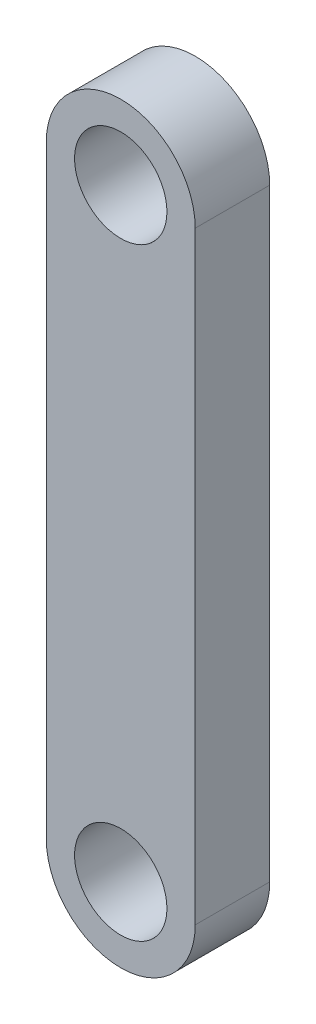
ISO-10303-21;
HEADER;
FILE_DESCRIPTION(('STEP AP214'),'2;1');
FILE_NAME('part.step','',(''),(''),'','','');
FILE_SCHEMA(('AUTOMOTIVE_DESIGN { 1 0 10303 214 1 1 1 1 }'));
ENDSEC;
DATA;
#1=APPLICATION_CONTEXT('core data for automotive mechanical design processes');
#2=APPLICATION_PROTOCOL_DEFINITION('international standard','automotive_design',2000,#1);
#3=PRODUCT_CONTEXT('',#1,'mechanical');
#4=PRODUCT('Part','Part','',(#3));
#5=PRODUCT_RELATED_PRODUCT_CATEGORY('part','',(#4));
#6=PRODUCT_DEFINITION_FORMATION('','',#4);
#7=PRODUCT_DEFINITION_CONTEXT('part definition',#1,'design');
#8=PRODUCT_DEFINITION('design','',#6,#7);
#9=PRODUCT_DEFINITION_SHAPE('','',#8);
#10=(LENGTH_UNIT() NAMED_UNIT(*) SI_UNIT(.MILLI.,.METRE.));
#11=(NAMED_UNIT(*) PLANE_ANGLE_UNIT() SI_UNIT($,.RADIAN.));
#12=(NAMED_UNIT(*) SI_UNIT($,.STERADIAN.) SOLID_ANGLE_UNIT());
#13=UNCERTAINTY_MEASURE_WITH_UNIT(LENGTH_MEASURE(1.E-05),#10,'distance_accuracy_value','');
#14=(GEOMETRIC_REPRESENTATION_CONTEXT(3) GLOBAL_UNCERTAINTY_ASSIGNED_CONTEXT((#13)) GLOBAL_UNIT_ASSIGNED_CONTEXT((#10,
#11,#12)) REPRESENTATION_CONTEXT('',''));
#15=CARTESIAN_POINT('',(0.,0.,0.));
#16=DIRECTION('',(0.,0.,1.));
#17=DIRECTION('',(1.,0.,0.));
#18=AXIS2_PLACEMENT_3D('',#15,#16,#17);
#19=CARTESIAN_POINT('',(0.,38.0750020317063,6.35));
#20=DIRECTION('',(0.,0.,1.));
#21=DIRECTION('',(1.,0.,0.));
#22=AXIS2_PLACEMENT_3D('',#19,#20,#21);
#23=PLANE('',#22);
#24=CARTESIAN_POINT('',(0.,38.0750020317063,6.35));
#25=DIRECTION('',(0.,0.,1.));
#26=DIRECTION('',(1.,0.,0.));
#27=AXIS2_PLACEMENT_3D('',#24,#25,#26);
#28=CIRCLE('',#27,3.937);
#29=CARTESIAN_POINT('',(3.937,38.0750020317063,6.35));
#30=VERTEX_POINT('',#29);
#31=EDGE_CURVE('E99',#30,#30,#28,.T.);
#32=ORIENTED_EDGE('',*,*,#31,.F.);
#33=EDGE_LOOP('',(#32));
#34=FACE_BOUND('',#33,.T.);
#35=CARTESIAN_POINT('',(0.,38.0750020317063,6.35));
#36=DIRECTION('',(0.,0.,1.));
#37=DIRECTION('',(1.,0.,0.));
#38=AXIS2_PLACEMENT_3D('',#35,#36,#37);
#39=CIRCLE('',#38,6.35);
#40=CARTESIAN_POINT('',(6.35,38.0750020317063,6.35));
#41=VERTEX_POINT('',#40);
#42=CARTESIAN_POINT('',(-6.35,38.0750020317063,6.35));
#43=VERTEX_POINT('',#42);
#44=EDGE_CURVE('E84',#41,#43,#39,.T.);
#45=ORIENTED_EDGE('',*,*,#44,.T.);
#46=DIRECTION('',(0.,-1.,0.));
#47=VECTOR('',#46,1.);
#48=CARTESIAN_POINT('',(-6.35,38.0750020317063,6.35));
#49=LINE('',#48,#47);
#50=CARTESIAN_POINT('',(-6.35,-13.3599979682937,6.35));
#51=VERTEX_POINT('',#50);
#52=EDGE_CURVE('E79',#43,#51,#49,.T.);
#53=ORIENTED_EDGE('',*,*,#52,.T.);
#54=CARTESIAN_POINT('',(0.,-13.3599979682937,6.35));
#55=DIRECTION('',(0.,0.,1.));
#56=DIRECTION('',(1.,0.,0.));
#57=AXIS2_PLACEMENT_3D('',#54,#55,#56);
#58=CIRCLE('',#57,6.35);
#59=CARTESIAN_POINT('',(6.35000000000001,-13.3599979682937,6.35));
#60=VERTEX_POINT('',#59);
#61=EDGE_CURVE('E82',#51,#60,#58,.T.);
#62=ORIENTED_EDGE('',*,*,#61,.T.);
#63=DIRECTION('',(0.,1.,0.));
#64=VECTOR('',#63,1.);
#65=CARTESIAN_POINT('',(6.35,38.0750020317063,6.35));
#66=LINE('',#65,#64);
#67=EDGE_CURVE('E49',#60,#41,#66,.T.);
#68=ORIENTED_EDGE('',*,*,#67,.T.);
#69=EDGE_LOOP('',(#45,#53,#62,#68));
#70=FACE_BOUND('',#69,.T.);
#71=CARTESIAN_POINT('',(0.,-13.3599979682937,6.35));
#72=DIRECTION('',(0.,0.,1.));
#73=DIRECTION('',(1.,0.,0.));
#74=AXIS2_PLACEMENT_3D('',#71,#72,#73);
#75=CIRCLE('',#74,3.937);
#76=CARTESIAN_POINT('',(3.937,-13.3599979682937,6.35));
#77=VERTEX_POINT('',#76);
#78=EDGE_CURVE('E114',#77,#77,#75,.T.);
#79=ORIENTED_EDGE('',*,*,#78,.F.);
#80=EDGE_LOOP('',(#79));
#81=FACE_BOUND('',#80,.T.);
#82=ADVANCED_FACE('F32',(#34,#70,#81),#23,.T.);
#83=CARTESIAN_POINT('',(0.,38.0750020317063,0.));
#84=DIRECTION('',(0.,0.,1.));
#85=DIRECTION('',(1.,0.,0.));
#86=AXIS2_PLACEMENT_3D('',#83,#84,#85);
#87=PLANE('',#86);
#88=CARTESIAN_POINT('',(0.,38.0750020317063,0.));
#89=DIRECTION('',(0.,0.,1.));
#90=DIRECTION('',(1.,0.,0.));
#91=AXIS2_PLACEMENT_3D('',#88,#89,#90);
#92=CIRCLE('',#91,6.35);
#93=CARTESIAN_POINT('',(6.35,38.0750020317063,0.));
#94=VERTEX_POINT('',#93);
#95=CARTESIAN_POINT('',(-6.35,38.0750020317063,0.));
#96=VERTEX_POINT('',#95);
#97=EDGE_CURVE('E96',#94,#96,#92,.T.);
#98=ORIENTED_EDGE('',*,*,#97,.F.);
#99=DIRECTION('',(0.,1.,0.));
#100=VECTOR('',#99,1.);
#101=CARTESIAN_POINT('',(6.35,38.0750020317063,0.));
#102=LINE('',#101,#100);
#103=CARTESIAN_POINT('',(6.35000000000001,-13.3599979682937,0.));
#104=VERTEX_POINT('',#103);
#105=EDGE_CURVE('E72',#104,#94,#102,.T.);
#106=ORIENTED_EDGE('',*,*,#105,.F.);
#107=CARTESIAN_POINT('',(0.,-13.3599979682937,0.));
#108=DIRECTION('',(0.,0.,1.));
#109=DIRECTION('',(1.,0.,0.));
#110=AXIS2_PLACEMENT_3D('',#107,#108,#109);
#111=CIRCLE('',#110,6.35);
#112=CARTESIAN_POINT('',(-6.35,-13.3599979682937,0.));
#113=VERTEX_POINT('',#112);
#114=EDGE_CURVE('E66',#113,#104,#111,.T.);
#115=ORIENTED_EDGE('',*,*,#114,.F.);
#116=DIRECTION('',(0.,-1.,0.));
#117=VECTOR('',#116,1.);
#118=CARTESIAN_POINT('',(-6.35,38.0750020317063,0.));
#119=LINE('',#118,#117);
#120=EDGE_CURVE('E88',#96,#113,#119,.T.);
#121=ORIENTED_EDGE('',*,*,#120,.F.);
#122=EDGE_LOOP('',(#98,#106,#115,#121));
#123=FACE_BOUND('',#122,.T.);
#124=CARTESIAN_POINT('',(0.,38.0750020317063,0.));
#125=DIRECTION('',(0.,0.,1.));
#126=DIRECTION('',(1.,0.,0.));
#127=AXIS2_PLACEMENT_3D('',#124,#125,#126);
#128=CIRCLE('',#127,3.937);
#129=CARTESIAN_POINT('',(3.937,38.0750020317063,0.));
#130=VERTEX_POINT('',#129);
#131=EDGE_CURVE('E111',#130,#130,#128,.T.);
#132=ORIENTED_EDGE('',*,*,#131,.T.);
#133=EDGE_LOOP('',(#132));
#134=FACE_BOUND('',#133,.T.);
#135=CARTESIAN_POINT('',(0.,-13.3599979682937,0.));
#136=DIRECTION('',(0.,0.,1.));
#137=DIRECTION('',(1.,0.,0.));
#138=AXIS2_PLACEMENT_3D('',#135,#136,#137);
#139=CIRCLE('',#138,3.937);
#140=CARTESIAN_POINT('',(3.937,-13.3599979682937,0.));
#141=VERTEX_POINT('',#140);
#142=EDGE_CURVE('E117',#141,#141,#139,.T.);
#143=ORIENTED_EDGE('',*,*,#142,.T.);
#144=EDGE_LOOP('',(#143));
#145=FACE_BOUND('',#144,.T.);
#146=ADVANCED_FACE('F107',(#123,#134,#145),#87,.F.);
#147=CARTESIAN_POINT('',(0.,38.0750020317063,6.35));
#148=DIRECTION('',(0.,0.,-1.));
#149=DIRECTION('',(-1.,0.,0.));
#150=AXIS2_PLACEMENT_3D('',#147,#148,#149);
#151=CYLINDRICAL_SURFACE('',#150,6.35);
#152=ORIENTED_EDGE('',*,*,#97,.T.);
#153=DIRECTION('',(0.,0.,-1.));
#154=VECTOR('',#153,1.);
#155=CARTESIAN_POINT('',(-6.35,38.0750020317063,6.35));
#156=LINE('',#155,#154);
#157=EDGE_CURVE('E11',#43,#96,#156,.T.);
#158=ORIENTED_EDGE('',*,*,#157,.F.);
#159=ORIENTED_EDGE('',*,*,#44,.F.);
#160=DIRECTION('',(0.,0.,-1.));
#161=VECTOR('',#160,1.);
#162=CARTESIAN_POINT('',(6.35,38.0750020317063,6.35));
#163=LINE('',#162,#161);
#164=EDGE_CURVE('E92',#41,#94,#163,.T.);
#165=ORIENTED_EDGE('',*,*,#164,.T.);
#166=EDGE_LOOP('',(#152,#158,#159,#165));
#167=FACE_BOUND('',#166,.T.);
#168=ADVANCED_FACE('F34',(#167),#151,.T.);
#169=CARTESIAN_POINT('',(-6.35,38.0750020317063,6.35));
#170=DIRECTION('',(1.,0.,0.));
#171=DIRECTION('',(0.,1.,0.));
#172=AXIS2_PLACEMENT_3D('',#169,#170,#171);
#173=PLANE('',#172);
#174=ORIENTED_EDGE('',*,*,#120,.T.);
#175=DIRECTION('',(0.,0.,-1.));
#176=VECTOR('',#175,1.);
#177=CARTESIAN_POINT('',(-6.35,-13.3599979682937,6.35));
#178=LINE('',#177,#176);
#179=EDGE_CURVE('E41',#51,#113,#178,.T.);
#180=ORIENTED_EDGE('',*,*,#179,.F.);
#181=ORIENTED_EDGE('',*,*,#52,.F.);
#182=ORIENTED_EDGE('',*,*,#157,.T.);
#183=EDGE_LOOP('',(#174,#180,#181,#182));
#184=FACE_BOUND('',#183,.T.);
#185=ADVANCED_FACE('F87',(#184),#173,.F.);
#186=CARTESIAN_POINT('',(0.,-13.3599979682937,6.35));
#187=DIRECTION('',(0.,0.,-1.));
#188=DIRECTION('',(-1.,0.,0.));
#189=AXIS2_PLACEMENT_3D('',#186,#187,#188);
#190=CYLINDRICAL_SURFACE('',#189,6.35);
#191=ORIENTED_EDGE('',*,*,#114,.T.);
#192=DIRECTION('',(0.,0.,-1.));
#193=VECTOR('',#192,1.);
#194=CARTESIAN_POINT('',(6.35000000000001,-13.3599979682937,6.35));
#195=LINE('',#194,#193);
#196=EDGE_CURVE('E89',#60,#104,#195,.T.);
#197=ORIENTED_EDGE('',*,*,#196,.F.);
#198=ORIENTED_EDGE('',*,*,#61,.F.);
#199=ORIENTED_EDGE('',*,*,#179,.T.);
#200=EDGE_LOOP('',(#191,#197,#198,#199));
#201=FACE_BOUND('',#200,.T.);
#202=ADVANCED_FACE('F90',(#201),#190,.T.);
#203=CARTESIAN_POINT('',(6.35,38.0750020317063,6.35));
#204=DIRECTION('',(-1.,0.,0.));
#205=DIRECTION('',(0.,-1.,0.));
#206=AXIS2_PLACEMENT_3D('',#203,#204,#205);
#207=PLANE('',#206);
#208=ORIENTED_EDGE('',*,*,#105,.T.);
#209=ORIENTED_EDGE('',*,*,#164,.F.);
#210=ORIENTED_EDGE('',*,*,#67,.F.);
#211=ORIENTED_EDGE('',*,*,#196,.T.);
#212=EDGE_LOOP('',(#208,#209,#210,#211));
#213=FACE_BOUND('',#212,.T.);
#214=ADVANCED_FACE('F104',(#213),#207,.F.);
#215=CARTESIAN_POINT('',(0.,38.0750020317063,6.35));
#216=DIRECTION('',(0.,0.,-1.));
#217=DIRECTION('',(-1.,0.,0.));
#218=AXIS2_PLACEMENT_3D('',#215,#216,#217);
#219=CYLINDRICAL_SURFACE('',#218,3.937);
#220=ORIENTED_EDGE('',*,*,#31,.T.);
#221=EDGE_LOOP('',(#220));
#222=FACE_BOUND('',#221,.T.);
#223=ORIENTED_EDGE('',*,*,#131,.F.);
#224=EDGE_LOOP('',(#223));
#225=FACE_BOUND('',#224,.T.);
#226=ADVANCED_FACE('F134',(#222,#225),#219,.F.);
#227=CARTESIAN_POINT('',(0.,-13.3599979682937,6.35));
#228=DIRECTION('',(0.,0.,-1.));
#229=DIRECTION('',(-1.,0.,0.));
#230=AXIS2_PLACEMENT_3D('',#227,#228,#229);
#231=CYLINDRICAL_SURFACE('',#230,3.937);
#232=ORIENTED_EDGE('',*,*,#78,.T.);
#233=EDGE_LOOP('',(#232));
#234=FACE_BOUND('',#233,.T.);
#235=ORIENTED_EDGE('',*,*,#142,.F.);
#236=EDGE_LOOP('',(#235));
#237=FACE_BOUND('',#236,.T.);
#238=ADVANCED_FACE('F123',(#234,#237),#231,.F.);
#239=CLOSED_SHELL('',(#82,#146,#168,#185,#202,#214,#226,#238));
#240=MANIFOLD_SOLID_BREP('B2',#239);
#241=ADVANCED_BREP_SHAPE_REPRESENTATION('',(#18,#240),#14);
#242=SHAPE_DEFINITION_REPRESENTATION(#9,#241);
ENDSEC;
END-ISO-10303-21;
